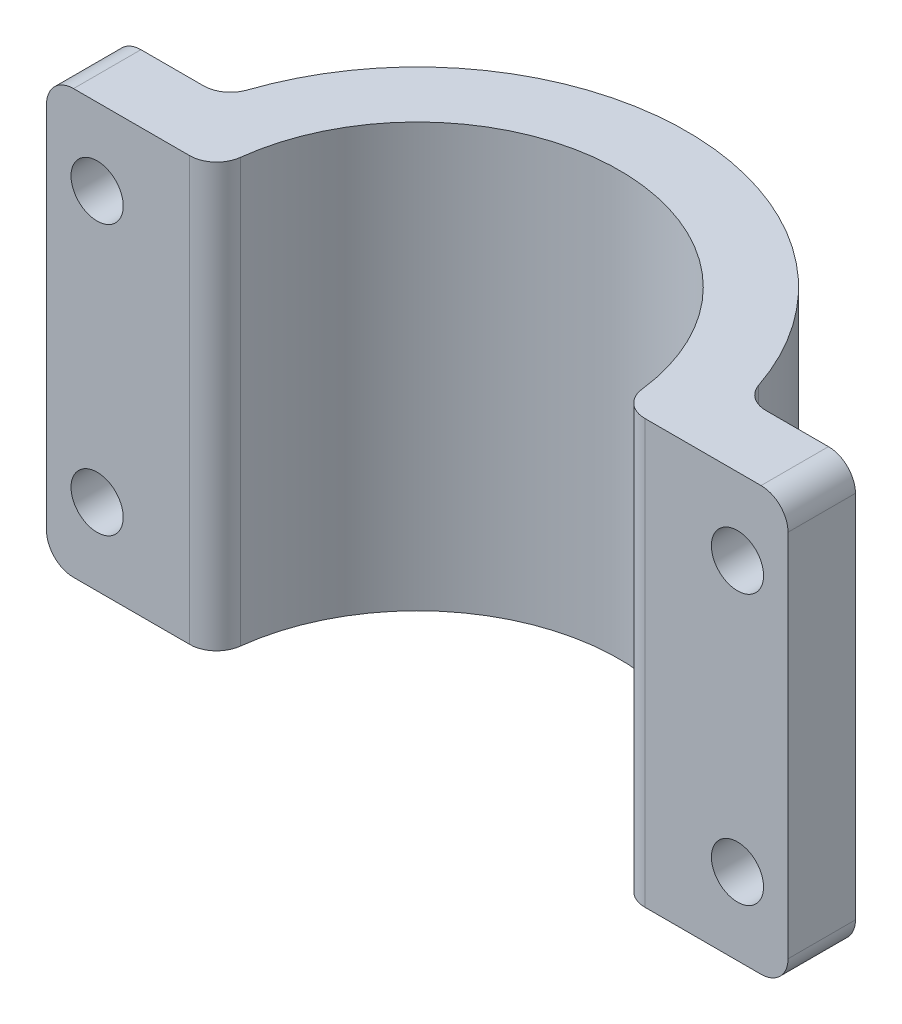
ISO-10303-21;
HEADER;
FILE_DESCRIPTION(('STEP AP214'),'2;1');
FILE_NAME('part.step','',(''),(''),'','','');
FILE_SCHEMA(('AUTOMOTIVE_DESIGN { 1 0 10303 214 1 1 1 1 }'));
ENDSEC;
DATA;
#1=APPLICATION_CONTEXT('core data for automotive mechanical design processes');
#2=APPLICATION_PROTOCOL_DEFINITION('international standard','automotive_design',2000,#1);
#3=PRODUCT_CONTEXT('',#1,'mechanical');
#4=PRODUCT('Part','Part','',(#3));
#5=PRODUCT_RELATED_PRODUCT_CATEGORY('part','',(#4));
#6=PRODUCT_DEFINITION_FORMATION('','',#4);
#7=PRODUCT_DEFINITION_CONTEXT('part definition',#1,'design');
#8=PRODUCT_DEFINITION('design','',#6,#7);
#9=PRODUCT_DEFINITION_SHAPE('','',#8);
#10=(LENGTH_UNIT() NAMED_UNIT(*) SI_UNIT(.MILLI.,.METRE.));
#11=(NAMED_UNIT(*) PLANE_ANGLE_UNIT() SI_UNIT($,.RADIAN.));
#12=(NAMED_UNIT(*) SI_UNIT($,.STERADIAN.) SOLID_ANGLE_UNIT());
#13=UNCERTAINTY_MEASURE_WITH_UNIT(LENGTH_MEASURE(1.E-05),#10,'distance_accuracy_value','');
#14=(GEOMETRIC_REPRESENTATION_CONTEXT(3) GLOBAL_UNCERTAINTY_ASSIGNED_CONTEXT((#13)) GLOBAL_UNIT_ASSIGNED_CONTEXT((#10,
#11,#12)) REPRESENTATION_CONTEXT('',''));
#15=CARTESIAN_POINT('',(0.,0.,0.));
#16=DIRECTION('',(0.,0.,1.));
#17=DIRECTION('',(1.,0.,0.));
#18=AXIS2_PLACEMENT_3D('',#15,#16,#17);
#19=CARTESIAN_POINT('',(-34.925,-39.878,0.));
#20=DIRECTION('',(-1.,0.,0.));
#21=DIRECTION('',(0.,0.,1.));
#22=AXIS2_PLACEMENT_3D('',#19,#20,#21);
#23=PLANE('',#22);
#24=DIRECTION('',(0.,1.,0.));
#25=VECTOR('',#24,1.);
#26=CARTESIAN_POINT('',(-34.925,-39.878,0.));
#27=LINE('',#26,#25);
#28=CARTESIAN_POINT('',(-34.925,-37.338,0.));
#29=VERTEX_POINT('',#28);
#30=CARTESIAN_POINT('',(-34.925,-2.54,0.));
#31=VERTEX_POINT('',#30);
#32=EDGE_CURVE('E257',#29,#31,#27,.T.);
#33=ORIENTED_EDGE('',*,*,#32,.T.);
#34=DIRECTION('',(0.,0.,1.));
#35=VECTOR('',#34,1.);
#36=CARTESIAN_POINT('',(-34.925,-2.54,0.));
#37=LINE('',#36,#35);
#38=CARTESIAN_POINT('',(-34.925,-2.54,-6.35));
#39=VERTEX_POINT('',#38);
#40=EDGE_CURVE('E191',#31,#39,#37,.F.);
#41=ORIENTED_EDGE('',*,*,#40,.T.);
#42=DIRECTION('',(0.,1.,0.));
#43=VECTOR('',#42,1.);
#44=CARTESIAN_POINT('',(-34.925,-39.878,-6.35));
#45=LINE('',#44,#43);
#46=CARTESIAN_POINT('',(-34.925,-37.338,-6.35));
#47=VERTEX_POINT('',#46);
#48=EDGE_CURVE('E245',#47,#39,#45,.T.);
#49=ORIENTED_EDGE('',*,*,#48,.F.);
#50=DIRECTION('',(0.,0.,1.));
#51=VECTOR('',#50,1.);
#52=CARTESIAN_POINT('',(-34.925,-37.338,0.));
#53=LINE('',#52,#51);
#54=EDGE_CURVE('E197',#47,#29,#53,.T.);
#55=ORIENTED_EDGE('',*,*,#54,.T.);
#56=EDGE_LOOP('',(#33,#41,#49,#55));
#57=FACE_BOUND('',#56,.T.);
#58=ADVANCED_FACE('F42',(#57),#23,.T.);
#59=CARTESIAN_POINT('',(-34.925,-39.878,-6.35));
#60=DIRECTION('',(0.,0.,-1.));
#61=DIRECTION('',(-1.,0.,0.));
#62=AXIS2_PLACEMENT_3D('',#59,#60,#61);
#63=PLANE('',#62);
#64=CARTESIAN_POINT('',(-30.1625,-7.239,-6.35));
#65=DIRECTION('',(0.,0.,-1.));
#66=DIRECTION('',(-1.,0.,0.));
#67=AXIS2_PLACEMENT_3D('',#64,#65,#66);
#68=CIRCLE('',#67,2.45744999999999);
#69=CARTESIAN_POINT('',(-32.61995,-7.239,-6.35));
#70=VERTEX_POINT('',#69);
#71=EDGE_CURVE('E399',#70,#70,#68,.T.);
#72=ORIENTED_EDGE('',*,*,#71,.F.);
#73=EDGE_LOOP('',(#72));
#74=FACE_BOUND('',#73,.T.);
#75=CARTESIAN_POINT('',(-30.1625,-32.639,-6.35));
#76=DIRECTION('',(0.,0.,-1.));
#77=DIRECTION('',(-1.,0.,0.));
#78=AXIS2_PLACEMENT_3D('',#75,#76,#77);
#79=CIRCLE('',#78,2.45744999999999);
#80=CARTESIAN_POINT('',(-32.61995,-32.639,-6.35));
#81=VERTEX_POINT('',#80);
#82=EDGE_CURVE('E391',#81,#81,#79,.T.);
#83=ORIENTED_EDGE('',*,*,#82,.F.);
#84=EDGE_LOOP('',(#83));
#85=FACE_BOUND('',#84,.T.);
#86=ORIENTED_EDGE('',*,*,#48,.T.);
#87=CARTESIAN_POINT('',(-32.385,-2.54,-6.35));
#88=DIRECTION('',(0.,0.,-1.));
#89=DIRECTION('',(-1.,0.,0.));
#90=AXIS2_PLACEMENT_3D('',#87,#88,#89);
#91=CIRCLE('',#90,2.54);
#92=CARTESIAN_POINT('',(-32.385,0.,-6.35));
#93=VERTEX_POINT('',#92);
#94=EDGE_CURVE('E283',#39,#93,#91,.T.);
#95=ORIENTED_EDGE('',*,*,#94,.T.);
#96=DIRECTION('',(-1.,0.,0.));
#97=VECTOR('',#96,1.);
#98=CARTESIAN_POINT('',(-34.925,0.,-6.35));
#99=LINE('',#98,#97);
#100=CARTESIAN_POINT('',(-26.48795009056,0.,-6.35));
#101=VERTEX_POINT('',#100);
#102=EDGE_CURVE('E206',#101,#93,#99,.T.);
#103=ORIENTED_EDGE('',*,*,#102,.F.);
#104=DIRECTION('',(0.,-1.,0.));
#105=VECTOR('',#104,1.);
#106=CARTESIAN_POINT('',(-26.48795009056,-39.878,-6.35));
#107=LINE('',#106,#105);
#108=CARTESIAN_POINT('',(-26.48795009056,-39.878,-6.35));
#109=VERTEX_POINT('',#108);
#110=EDGE_CURVE('E277',#101,#109,#107,.T.);
#111=ORIENTED_EDGE('',*,*,#110,.T.);
#112=DIRECTION('',(-1.,0.,0.));
#113=VECTOR('',#112,1.);
#114=CARTESIAN_POINT('',(-34.925,-39.878,-6.35));
#115=LINE('',#114,#113);
#116=CARTESIAN_POINT('',(-32.385,-39.878,-6.35));
#117=VERTEX_POINT('',#116);
#118=EDGE_CURVE('E228',#109,#117,#115,.T.);
#119=ORIENTED_EDGE('',*,*,#118,.T.);
#120=CARTESIAN_POINT('',(-32.385,-37.338,-6.35));
#121=DIRECTION('',(0.,0.,-1.));
#122=DIRECTION('',(-1.,0.,0.));
#123=AXIS2_PLACEMENT_3D('',#120,#121,#122);
#124=CIRCLE('',#123,2.54);
#125=EDGE_CURVE('E280',#117,#47,#124,.T.);
#126=ORIENTED_EDGE('',*,*,#125,.T.);
#127=EDGE_LOOP('',(#86,#95,#103,#111,#119,#126));
#128=FACE_BOUND('',#127,.T.);
#129=ADVANCED_FACE('F345',(#74,#85,#128),#63,.T.);
#130=CARTESIAN_POINT('',(0.,-39.878,0.));
#131=DIRECTION('',(0.,1.,0.));
#132=DIRECTION('',(0.,0.,1.));
#133=AXIS2_PLACEMENT_3D('',#130,#131,#132);
#134=CYLINDRICAL_SURFACE('',#133,25.4);
#135=CARTESIAN_POINT('',(0.,0.,0.));
#136=DIRECTION('',(0.,1.,0.));
#137=DIRECTION('',(0.,0.,1.));
#138=AXIS2_PLACEMENT_3D('',#135,#136,#137);
#139=CIRCLE('',#138,25.4);
#140=CARTESIAN_POINT('',(24.0799546277819,0.,-8.08181818181818));
#141=VERTEX_POINT('',#140);
#142=CARTESIAN_POINT('',(-24.0799546277819,0.,-8.08181818181818));
#143=VERTEX_POINT('',#142);
#144=EDGE_CURVE('E238',#141,#143,#139,.T.);
#145=ORIENTED_EDGE('',*,*,#144,.F.);
#146=DIRECTION('',(0.,1.,0.));
#147=VECTOR('',#146,1.);
#148=CARTESIAN_POINT('',(24.0799546277819,-39.878,-8.08181818181818));
#149=LINE('',#148,#147);
#150=CARTESIAN_POINT('',(24.0799546277819,-39.878,-8.08181818181818));
#151=VERTEX_POINT('',#150);
#152=EDGE_CURVE('E331',#141,#151,#149,.F.);
#153=ORIENTED_EDGE('',*,*,#152,.T.);
#154=CARTESIAN_POINT('',(0.,-39.878,0.));
#155=DIRECTION('',(0.,1.,0.));
#156=DIRECTION('',(0.,0.,1.));
#157=AXIS2_PLACEMENT_3D('',#154,#155,#156);
#158=CIRCLE('',#157,25.4);
#159=CARTESIAN_POINT('',(-24.0799546277819,-39.878,-8.08181818181818));
#160=VERTEX_POINT('',#159);
#161=EDGE_CURVE('E355',#151,#160,#158,.T.);
#162=ORIENTED_EDGE('',*,*,#161,.T.);
#163=DIRECTION('',(0.,1.,0.));
#164=VECTOR('',#163,1.);
#165=CARTESIAN_POINT('',(-24.0799546277819,-39.878,-8.08181818181818));
#166=LINE('',#165,#164);
#167=EDGE_CURVE('E327',#160,#143,#166,.T.);
#168=ORIENTED_EDGE('',*,*,#167,.T.);
#169=EDGE_LOOP('',(#145,#153,#162,#168));
#170=FACE_BOUND('',#169,.T.);
#171=ADVANCED_FACE('F358',(#170),#134,.T.);
#172=CARTESIAN_POINT('',(34.925,-39.878,-6.35));
#173=DIRECTION('',(0.,0.,-1.));
#174=DIRECTION('',(-1.,0.,0.));
#175=AXIS2_PLACEMENT_3D('',#172,#173,#174);
#176=PLANE('',#175);
#177=CARTESIAN_POINT('',(30.1625,-7.239,-6.35));
#178=DIRECTION('',(0.,0.,-1.));
#179=DIRECTION('',(-1.,0.,0.));
#180=AXIS2_PLACEMENT_3D('',#177,#178,#179);
#181=CIRCLE('',#180,2.45744999999999);
#182=CARTESIAN_POINT('',(27.70505,-7.239,-6.35));
#183=VERTEX_POINT('',#182);
#184=EDGE_CURVE('E383',#183,#183,#181,.T.);
#185=ORIENTED_EDGE('',*,*,#184,.F.);
#186=EDGE_LOOP('',(#185));
#187=FACE_BOUND('',#186,.T.);
#188=CARTESIAN_POINT('',(30.1625,-32.639,-6.35));
#189=DIRECTION('',(0.,0.,-1.));
#190=DIRECTION('',(-1.,0.,0.));
#191=AXIS2_PLACEMENT_3D('',#188,#189,#190);
#192=CIRCLE('',#191,2.45744999999999);
#193=CARTESIAN_POINT('',(27.70505,-32.639,-6.35));
#194=VERTEX_POINT('',#193);
#195=EDGE_CURVE('E225',#194,#194,#192,.T.);
#196=ORIENTED_EDGE('',*,*,#195,.F.);
#197=EDGE_LOOP('',(#196));
#198=FACE_BOUND('',#197,.T.);
#199=DIRECTION('',(0.,1.,0.));
#200=VECTOR('',#199,1.);
#201=CARTESIAN_POINT('',(34.925,-39.878,-6.35));
#202=LINE('',#201,#200);
#203=CARTESIAN_POINT('',(34.925,-37.338,-6.35));
#204=VERTEX_POINT('',#203);
#205=CARTESIAN_POINT('',(34.925,-2.54,-6.35));
#206=VERTEX_POINT('',#205);
#207=EDGE_CURVE('E250',#204,#206,#202,.T.);
#208=ORIENTED_EDGE('',*,*,#207,.F.);
#209=CARTESIAN_POINT('',(32.385,-37.338,-6.35));
#210=DIRECTION('',(0.,0.,-1.));
#211=DIRECTION('',(-1.,0.,0.));
#212=AXIS2_PLACEMENT_3D('',#209,#210,#211);
#213=CIRCLE('',#212,2.54);
#214=CARTESIAN_POINT('',(32.385,-39.878,-6.35));
#215=VERTEX_POINT('',#214);
#216=EDGE_CURVE('E71',#204,#215,#213,.T.);
#217=ORIENTED_EDGE('',*,*,#216,.T.);
#218=DIRECTION('',(-1.,0.,0.));
#219=VECTOR('',#218,1.);
#220=CARTESIAN_POINT('',(34.925,-39.878,-6.35));
#221=LINE('',#220,#219);
#222=CARTESIAN_POINT('',(26.48795009056,-39.878,-6.35));
#223=VERTEX_POINT('',#222);
#224=EDGE_CURVE('E361',#215,#223,#221,.T.);
#225=ORIENTED_EDGE('',*,*,#224,.T.);
#226=DIRECTION('',(0.,-1.,0.));
#227=VECTOR('',#226,1.);
#228=CARTESIAN_POINT('',(26.48795009056,0.,-6.35));
#229=LINE('',#228,#227);
#230=CARTESIAN_POINT('',(26.48795009056,0.,-6.35));
#231=VERTEX_POINT('',#230);
#232=EDGE_CURVE('E304',#223,#231,#229,.F.);
#233=ORIENTED_EDGE('',*,*,#232,.T.);
#234=DIRECTION('',(-1.,0.,0.));
#235=VECTOR('',#234,1.);
#236=CARTESIAN_POINT('',(34.925,0.,-6.35));
#237=LINE('',#236,#235);
#238=CARTESIAN_POINT('',(32.385,0.,-6.35));
#239=VERTEX_POINT('',#238);
#240=EDGE_CURVE('E234',#239,#231,#237,.T.);
#241=ORIENTED_EDGE('',*,*,#240,.F.);
#242=CARTESIAN_POINT('',(32.385,-2.54,-6.35));
#243=DIRECTION('',(0.,0.,-1.));
#244=DIRECTION('',(-1.,0.,0.));
#245=AXIS2_PLACEMENT_3D('',#242,#243,#244);
#246=CIRCLE('',#245,2.54);
#247=EDGE_CURVE('E61',#239,#206,#246,.T.);
#248=ORIENTED_EDGE('',*,*,#247,.T.);
#249=EDGE_LOOP('',(#208,#217,#225,#233,#241,#248));
#250=FACE_BOUND('',#249,.T.);
#251=ADVANCED_FACE('F485',(#187,#198,#250),#176,.T.);
#252=CARTESIAN_POINT('',(34.925,-39.878,0.));
#253=DIRECTION('',(1.,0.,0.));
#254=DIRECTION('',(0.,0.,-1.));
#255=AXIS2_PLACEMENT_3D('',#252,#253,#254);
#256=PLANE('',#255);
#257=DIRECTION('',(0.,1.,0.));
#258=VECTOR('',#257,1.);
#259=CARTESIAN_POINT('',(34.925,-39.878,0.));
#260=LINE('',#259,#258);
#261=CARTESIAN_POINT('',(34.925,-37.338,0.));
#262=VERTEX_POINT('',#261);
#263=CARTESIAN_POINT('',(34.925,-2.54,0.));
#264=VERTEX_POINT('',#263);
#265=EDGE_CURVE('E253',#262,#264,#260,.T.);
#266=ORIENTED_EDGE('',*,*,#265,.F.);
#267=DIRECTION('',(0.,0.,-1.));
#268=VECTOR('',#267,1.);
#269=CARTESIAN_POINT('',(34.925,-37.338,-6.35));
#270=LINE('',#269,#268);
#271=EDGE_CURVE('E301',#262,#204,#270,.T.);
#272=ORIENTED_EDGE('',*,*,#271,.T.);
#273=ORIENTED_EDGE('',*,*,#207,.T.);
#274=DIRECTION('',(0.,0.,-1.));
#275=VECTOR('',#274,1.);
#276=CARTESIAN_POINT('',(34.925,-2.54,0.));
#277=LINE('',#276,#275);
#278=EDGE_CURVE('E298',#206,#264,#277,.F.);
#279=ORIENTED_EDGE('',*,*,#278,.T.);
#280=EDGE_LOOP('',(#266,#272,#273,#279));
#281=FACE_BOUND('',#280,.T.);
#282=ADVANCED_FACE('F490',(#281),#256,.T.);
#283=CARTESIAN_POINT('',(19.05,-39.878,0.));
#284=DIRECTION('',(0.,0.,1.));
#285=DIRECTION('',(1.,0.,0.));
#286=AXIS2_PLACEMENT_3D('',#283,#284,#285);
#287=PLANE('',#286);
#288=CARTESIAN_POINT('',(30.1625,-7.239,0.));
#289=DIRECTION('',(0.,0.,-1.));
#290=DIRECTION('',(-1.,0.,0.));
#291=AXIS2_PLACEMENT_3D('',#288,#289,#290);
#292=CIRCLE('',#291,2.45744999999999);
#293=CARTESIAN_POINT('',(27.70505,-7.239,0.));
#294=VERTEX_POINT('',#293);
#295=EDGE_CURVE('E379',#294,#294,#292,.T.);
#296=ORIENTED_EDGE('',*,*,#295,.T.);
#297=EDGE_LOOP('',(#296));
#298=FACE_BOUND('',#297,.T.);
#299=CARTESIAN_POINT('',(30.1625,-32.639,0.));
#300=DIRECTION('',(0.,0.,-1.));
#301=DIRECTION('',(-1.,0.,0.));
#302=AXIS2_PLACEMENT_3D('',#299,#300,#301);
#303=CIRCLE('',#302,2.45745);
#304=CARTESIAN_POINT('',(27.70505,-32.639,0.));
#305=VERTEX_POINT('',#304);
#306=EDGE_CURVE('E217',#305,#305,#303,.T.);
#307=ORIENTED_EDGE('',*,*,#306,.T.);
#308=EDGE_LOOP('',(#307));
#309=FACE_BOUND('',#308,.T.);
#310=DIRECTION('',(1.,0.,0.));
#311=VECTOR('',#310,1.);
#312=CARTESIAN_POINT('',(19.05,-39.878,0.));
#313=LINE('',#312,#311);
#314=CARTESIAN_POINT('',(21.4400676304903,-39.878,0.));
#315=VERTEX_POINT('',#314);
#316=CARTESIAN_POINT('',(32.385,-39.878,0.));
#317=VERTEX_POINT('',#316);
#318=EDGE_CURVE('E366',#315,#317,#313,.T.);
#319=ORIENTED_EDGE('',*,*,#318,.T.);
#320=CARTESIAN_POINT('',(32.385,-37.338,0.));
#321=DIRECTION('',(0.,0.,1.));
#322=DIRECTION('',(1.,0.,0.));
#323=AXIS2_PLACEMENT_3D('',#320,#321,#322);
#324=CIRCLE('',#323,2.54);
#325=EDGE_CURVE('E318',#317,#262,#324,.T.);
#326=ORIENTED_EDGE('',*,*,#325,.T.);
#327=ORIENTED_EDGE('',*,*,#265,.T.);
#328=CARTESIAN_POINT('',(32.385,-2.54,0.));
#329=DIRECTION('',(0.,0.,1.));
#330=DIRECTION('',(1.,0.,0.));
#331=AXIS2_PLACEMENT_3D('',#328,#329,#330);
#332=CIRCLE('',#331,2.54);
#333=CARTESIAN_POINT('',(32.385,0.,0.));
#334=VERTEX_POINT('',#333);
#335=EDGE_CURVE('E315',#264,#334,#332,.T.);
#336=ORIENTED_EDGE('',*,*,#335,.T.);
#337=DIRECTION('',(1.,0.,0.));
#338=VECTOR('',#337,1.);
#339=CARTESIAN_POINT('',(19.05,0.,0.));
#340=LINE('',#339,#338);
#341=CARTESIAN_POINT('',(21.4400676304903,0.,0.));
#342=VERTEX_POINT('',#341);
#343=EDGE_CURVE('E221',#342,#334,#340,.T.);
#344=ORIENTED_EDGE('',*,*,#343,.F.);
#345=DIRECTION('',(0.,1.,0.));
#346=VECTOR('',#345,1.);
#347=CARTESIAN_POINT('',(21.4400676304903,-39.878,0.));
#348=LINE('',#347,#346);
#349=EDGE_CURVE('E312',#342,#315,#348,.F.);
#350=ORIENTED_EDGE('',*,*,#349,.T.);
#351=EDGE_LOOP('',(#319,#326,#327,#336,#344,#350));
#352=FACE_BOUND('',#351,.T.);
#353=ADVANCED_FACE('F481',(#298,#309,#352),#287,.T.);
#354=CARTESIAN_POINT('',(0.,-39.878,0.));
#355=DIRECTION('',(0.,1.,0.));
#356=DIRECTION('',(0.,0.,1.));
#357=AXIS2_PLACEMENT_3D('',#354,#355,#356);
#358=CYLINDRICAL_SURFACE('',#357,19.05);
#359=CARTESIAN_POINT('',(0.,-39.878,0.));
#360=DIRECTION('',(0.,-1.,0.));
#361=DIRECTION('',(0.,0.,1.));
#362=AXIS2_PLACEMENT_3D('',#359,#360,#361);
#363=CIRCLE('',#362,19.05);
#364=CARTESIAN_POINT('',(-18.9177067327856,-39.878,-2.24117647058824));
#365=VERTEX_POINT('',#364);
#366=CARTESIAN_POINT('',(18.9177067327856,-39.878,-2.24117647058824));
#367=VERTEX_POINT('',#366);
#368=EDGE_CURVE('E371',#365,#367,#363,.T.);
#369=ORIENTED_EDGE('',*,*,#368,.T.);
#370=DIRECTION('',(0.,1.,0.));
#371=VECTOR('',#370,1.);
#372=CARTESIAN_POINT('',(18.9177067327856,-39.878,-2.24117647058824));
#373=LINE('',#372,#371);
#374=CARTESIAN_POINT('',(18.9177067327856,0.,-2.24117647058824));
#375=VERTEX_POINT('',#374);
#376=EDGE_CURVE('E323',#367,#375,#373,.T.);
#377=ORIENTED_EDGE('',*,*,#376,.T.);
#378=CARTESIAN_POINT('',(0.,0.,0.));
#379=DIRECTION('',(0.,-1.,0.));
#380=DIRECTION('',(0.,0.,1.));
#381=AXIS2_PLACEMENT_3D('',#378,#379,#380);
#382=CIRCLE('',#381,19.05);
#383=CARTESIAN_POINT('',(-18.9177067327856,0.,-2.24117647058824));
#384=VERTEX_POINT('',#383);
#385=EDGE_CURVE('E216',#384,#375,#382,.T.);
#386=ORIENTED_EDGE('',*,*,#385,.F.);
#387=DIRECTION('',(0.,1.,0.));
#388=VECTOR('',#387,1.);
#389=CARTESIAN_POINT('',(-18.9177067327856,-39.878,-2.24117647058824));
#390=LINE('',#389,#388);
#391=EDGE_CURVE('E320',#384,#365,#390,.F.);
#392=ORIENTED_EDGE('',*,*,#391,.T.);
#393=EDGE_LOOP('',(#369,#377,#386,#392));
#394=FACE_BOUND('',#393,.T.);
#395=ADVANCED_FACE('F475',(#394),#358,.F.);
#396=CARTESIAN_POINT('',(-34.925,-39.878,0.));
#397=DIRECTION('',(0.,0.,1.));
#398=DIRECTION('',(1.,0.,0.));
#399=AXIS2_PLACEMENT_3D('',#396,#397,#398);
#400=PLANE('',#399);
#401=CARTESIAN_POINT('',(-30.1625,-7.239,0.));
#402=DIRECTION('',(0.,0.,-1.));
#403=DIRECTION('',(-1.,0.,0.));
#404=AXIS2_PLACEMENT_3D('',#401,#402,#403);
#405=CIRCLE('',#404,2.45745);
#406=CARTESIAN_POINT('',(-32.61995,-7.239,0.));
#407=VERTEX_POINT('',#406);
#408=EDGE_CURVE('E395',#407,#407,#405,.T.);
#409=ORIENTED_EDGE('',*,*,#408,.T.);
#410=EDGE_LOOP('',(#409));
#411=FACE_BOUND('',#410,.T.);
#412=CARTESIAN_POINT('',(-30.1625,-32.639,0.));
#413=DIRECTION('',(0.,0.,-1.));
#414=DIRECTION('',(-1.,0.,0.));
#415=AXIS2_PLACEMENT_3D('',#412,#413,#414);
#416=CIRCLE('',#415,2.45745);
#417=CARTESIAN_POINT('',(-32.61995,-32.639,0.));
#418=VERTEX_POINT('',#417);
#419=EDGE_CURVE('E387',#418,#418,#416,.T.);
#420=ORIENTED_EDGE('',*,*,#419,.T.);
#421=EDGE_LOOP('',(#420));
#422=FACE_BOUND('',#421,.T.);
#423=DIRECTION('',(1.,0.,0.));
#424=VECTOR('',#423,1.);
#425=CARTESIAN_POINT('',(-34.925,0.,0.));
#426=LINE('',#425,#424);
#427=CARTESIAN_POINT('',(-32.385,0.,0.));
#428=VERTEX_POINT('',#427);
#429=CARTESIAN_POINT('',(-21.4400676304903,0.,0.));
#430=VERTEX_POINT('',#429);
#431=EDGE_CURVE('E204',#428,#430,#426,.T.);
#432=ORIENTED_EDGE('',*,*,#431,.F.);
#433=CARTESIAN_POINT('',(-32.385,-2.54,0.));
#434=DIRECTION('',(0.,0.,1.));
#435=DIRECTION('',(1.,0.,0.));
#436=AXIS2_PLACEMENT_3D('',#433,#434,#435);
#437=CIRCLE('',#436,2.54);
#438=EDGE_CURVE('E186',#428,#31,#437,.T.);
#439=ORIENTED_EDGE('',*,*,#438,.T.);
#440=ORIENTED_EDGE('',*,*,#32,.F.);
#441=CARTESIAN_POINT('',(-32.385,-37.338,0.));
#442=DIRECTION('',(0.,0.,1.));
#443=DIRECTION('',(1.,0.,0.));
#444=AXIS2_PLACEMENT_3D('',#441,#442,#443);
#445=CIRCLE('',#444,2.54);
#446=CARTESIAN_POINT('',(-32.385,-39.878,0.));
#447=VERTEX_POINT('',#446);
#448=EDGE_CURVE('E198',#29,#447,#445,.T.);
#449=ORIENTED_EDGE('',*,*,#448,.T.);
#450=DIRECTION('',(1.,0.,0.));
#451=VECTOR('',#450,1.);
#452=CARTESIAN_POINT('',(-34.925,-39.878,0.));
#453=LINE('',#452,#451);
#454=CARTESIAN_POINT('',(-21.4400676304903,-39.878,0.));
#455=VERTEX_POINT('',#454);
#456=EDGE_CURVE('E244',#447,#455,#453,.T.);
#457=ORIENTED_EDGE('',*,*,#456,.T.);
#458=DIRECTION('',(0.,1.,0.));
#459=VECTOR('',#458,1.);
#460=CARTESIAN_POINT('',(-21.4400676304903,-39.878,0.));
#461=LINE('',#460,#459);
#462=EDGE_CURVE('E208',#455,#430,#461,.T.);
#463=ORIENTED_EDGE('',*,*,#462,.T.);
#464=EDGE_LOOP('',(#432,#439,#440,#449,#457,#463));
#465=FACE_BOUND('',#464,.T.);
#466=ADVANCED_FACE('F212',(#411,#422,#465),#400,.T.);
#467=CARTESIAN_POINT('',(0.,-39.878,0.));
#468=DIRECTION('',(0.,1.,0.));
#469=DIRECTION('',(0.,0.,1.));
#470=AXIS2_PLACEMENT_3D('',#467,#468,#469);
#471=PLANE('',#470);
#472=ORIENTED_EDGE('',*,*,#456,.F.);
#473=DIRECTION('',(0.,0.,1.));
#474=VECTOR('',#473,1.);
#475=CARTESIAN_POINT('',(-32.385,-39.878,-6.35));
#476=LINE('',#475,#474);
#477=EDGE_CURVE('E295',#447,#117,#476,.F.);
#478=ORIENTED_EDGE('',*,*,#477,.T.);
#479=ORIENTED_EDGE('',*,*,#118,.F.);
#480=CARTESIAN_POINT('',(-26.48795009056,-39.878,-8.89));
#481=DIRECTION('',(0.,1.,0.));
#482=DIRECTION('',(0.,0.,1.));
#483=AXIS2_PLACEMENT_3D('',#480,#481,#482);
#484=CIRCLE('',#483,2.54);
#485=EDGE_CURVE('E11',#109,#160,#484,.T.);
#486=ORIENTED_EDGE('',*,*,#485,.T.);
#487=ORIENTED_EDGE('',*,*,#161,.F.);
#488=CARTESIAN_POINT('',(26.48795009056,-39.878,-8.89));
#489=DIRECTION('',(0.,1.,0.));
#490=DIRECTION('',(0.,0.,1.));
#491=AXIS2_PLACEMENT_3D('',#488,#489,#490);
#492=CIRCLE('',#491,2.54);
#493=EDGE_CURVE('E337',#151,#223,#492,.T.);
#494=ORIENTED_EDGE('',*,*,#493,.T.);
#495=ORIENTED_EDGE('',*,*,#224,.F.);
#496=DIRECTION('',(0.,0.,-1.));
#497=VECTOR('',#496,1.);
#498=CARTESIAN_POINT('',(32.385,-39.878,0.));
#499=LINE('',#498,#497);
#500=EDGE_CURVE('E292',#215,#317,#499,.F.);
#501=ORIENTED_EDGE('',*,*,#500,.T.);
#502=ORIENTED_EDGE('',*,*,#318,.F.);
#503=CARTESIAN_POINT('',(21.4400676304903,-39.878,-2.54));
#504=DIRECTION('',(0.,1.,0.));
#505=DIRECTION('',(0.,0.,1.));
#506=AXIS2_PLACEMENT_3D('',#503,#504,#505);
#507=CIRCLE('',#506,2.54);
#508=EDGE_CURVE('E289',#315,#367,#507,.F.);
#509=ORIENTED_EDGE('',*,*,#508,.T.);
#510=ORIENTED_EDGE('',*,*,#368,.F.);
#511=CARTESIAN_POINT('',(-21.4400676304903,-39.878,-2.54));
#512=DIRECTION('',(0.,1.,0.));
#513=DIRECTION('',(0.,0.,1.));
#514=AXIS2_PLACEMENT_3D('',#511,#512,#513);
#515=CIRCLE('',#514,2.54);
#516=EDGE_CURVE('E286',#365,#455,#515,.F.);
#517=ORIENTED_EDGE('',*,*,#516,.T.);
#518=EDGE_LOOP('',(#472,#478,#479,#486,#487,#494,#495,#501,#502,#509,#510,#517));
#519=FACE_BOUND('',#518,.T.);
#520=ADVANCED_FACE('F354',(#519),#471,.F.);
#521=CARTESIAN_POINT('',(0.,0.,0.));
#522=DIRECTION('',(0.,1.,0.));
#523=DIRECTION('',(0.,0.,1.));
#524=AXIS2_PLACEMENT_3D('',#521,#522,#523);
#525=PLANE('',#524);
#526=ORIENTED_EDGE('',*,*,#102,.T.);
#527=DIRECTION('',(0.,0.,1.));
#528=VECTOR('',#527,1.);
#529=CARTESIAN_POINT('',(-32.385,0.,0.));
#530=LINE('',#529,#528);
#531=EDGE_CURVE('E190',#93,#428,#530,.T.);
#532=ORIENTED_EDGE('',*,*,#531,.T.);
#533=ORIENTED_EDGE('',*,*,#431,.T.);
#534=CARTESIAN_POINT('',(-21.4400676304903,0.,-2.54));
#535=DIRECTION('',(0.,1.,0.));
#536=DIRECTION('',(0.,0.,1.));
#537=AXIS2_PLACEMENT_3D('',#534,#535,#536);
#538=CIRCLE('',#537,2.54);
#539=EDGE_CURVE('E249',#430,#384,#538,.T.);
#540=ORIENTED_EDGE('',*,*,#539,.T.);
#541=ORIENTED_EDGE('',*,*,#385,.T.);
#542=CARTESIAN_POINT('',(21.4400676304903,0.,-2.54));
#543=DIRECTION('',(0.,1.,0.));
#544=DIRECTION('',(0.,0.,1.));
#545=AXIS2_PLACEMENT_3D('',#542,#543,#544);
#546=CIRCLE('',#545,2.54);
#547=EDGE_CURVE('E262',#375,#342,#546,.T.);
#548=ORIENTED_EDGE('',*,*,#547,.T.);
#549=ORIENTED_EDGE('',*,*,#343,.T.);
#550=DIRECTION('',(0.,0.,-1.));
#551=VECTOR('',#550,1.);
#552=CARTESIAN_POINT('',(32.385,0.,0.));
#553=LINE('',#552,#551);
#554=EDGE_CURVE('E209',#334,#239,#553,.T.);
#555=ORIENTED_EDGE('',*,*,#554,.T.);
#556=ORIENTED_EDGE('',*,*,#240,.T.);
#557=CARTESIAN_POINT('',(26.48795009056,0.,-8.89));
#558=DIRECTION('',(0.,1.,0.));
#559=DIRECTION('',(0.,0.,1.));
#560=AXIS2_PLACEMENT_3D('',#557,#558,#559);
#561=CIRCLE('',#560,2.54);
#562=EDGE_CURVE('E334',#231,#141,#561,.F.);
#563=ORIENTED_EDGE('',*,*,#562,.T.);
#564=ORIENTED_EDGE('',*,*,#144,.T.);
#565=CARTESIAN_POINT('',(-26.48795009056,0.,-8.89));
#566=DIRECTION('',(0.,1.,0.));
#567=DIRECTION('',(0.,0.,1.));
#568=AXIS2_PLACEMENT_3D('',#565,#566,#567);
#569=CIRCLE('',#568,2.54);
#570=EDGE_CURVE('E51',#143,#101,#569,.F.);
#571=ORIENTED_EDGE('',*,*,#570,.T.);
#572=EDGE_LOOP('',(#526,#532,#533,#540,#541,#548,#549,#555,#556,#563,#564,#571));
#573=FACE_BOUND('',#572,.T.);
#574=ADVANCED_FACE('F203',(#573),#525,.T.);
#575=CARTESIAN_POINT('',(-32.385,-2.54,0.));
#576=DIRECTION('',(0.,0.,1.));
#577=DIRECTION('',(1.,0.,0.));
#578=AXIS2_PLACEMENT_3D('',#575,#576,#577);
#579=CYLINDRICAL_SURFACE('',#578,2.54);
#580=ORIENTED_EDGE('',*,*,#94,.F.);
#581=ORIENTED_EDGE('',*,*,#40,.F.);
#582=ORIENTED_EDGE('',*,*,#438,.F.);
#583=ORIENTED_EDGE('',*,*,#531,.F.);
#584=EDGE_LOOP('',(#580,#581,#582,#583));
#585=FACE_BOUND('',#584,.T.);
#586=ADVANCED_FACE('F189',(#585),#579,.T.);
#587=CARTESIAN_POINT('',(-32.385,-37.338,0.));
#588=DIRECTION('',(0.,0.,-1.));
#589=DIRECTION('',(-1.,0.,0.));
#590=AXIS2_PLACEMENT_3D('',#587,#588,#589);
#591=CYLINDRICAL_SURFACE('',#590,2.54);
#592=ORIENTED_EDGE('',*,*,#125,.F.);
#593=ORIENTED_EDGE('',*,*,#477,.F.);
#594=ORIENTED_EDGE('',*,*,#448,.F.);
#595=ORIENTED_EDGE('',*,*,#54,.F.);
#596=EDGE_LOOP('',(#592,#593,#594,#595));
#597=FACE_BOUND('',#596,.T.);
#598=ADVANCED_FACE('F436',(#597),#591,.T.);
#599=CARTESIAN_POINT('',(32.385,-37.338,0.));
#600=DIRECTION('',(0.,0.,1.));
#601=DIRECTION('',(1.,0.,0.));
#602=AXIS2_PLACEMENT_3D('',#599,#600,#601);
#603=CYLINDRICAL_SURFACE('',#602,2.54);
#604=ORIENTED_EDGE('',*,*,#325,.F.);
#605=ORIENTED_EDGE('',*,*,#500,.F.);
#606=ORIENTED_EDGE('',*,*,#216,.F.);
#607=ORIENTED_EDGE('',*,*,#271,.F.);
#608=EDGE_LOOP('',(#604,#605,#606,#607));
#609=FACE_BOUND('',#608,.T.);
#610=ADVANCED_FACE('F439',(#609),#603,.T.);
#611=CARTESIAN_POINT('',(32.385,-2.54,0.));
#612=DIRECTION('',(0.,0.,-1.));
#613=DIRECTION('',(-1.,0.,0.));
#614=AXIS2_PLACEMENT_3D('',#611,#612,#613);
#615=CYLINDRICAL_SURFACE('',#614,2.54);
#616=ORIENTED_EDGE('',*,*,#335,.F.);
#617=ORIENTED_EDGE('',*,*,#278,.F.);
#618=ORIENTED_EDGE('',*,*,#247,.F.);
#619=ORIENTED_EDGE('',*,*,#554,.F.);
#620=EDGE_LOOP('',(#616,#617,#618,#619));
#621=FACE_BOUND('',#620,.T.);
#622=ADVANCED_FACE('F443',(#621),#615,.T.);
#623=CARTESIAN_POINT('',(21.4400676304903,-39.878,-2.54));
#624=DIRECTION('',(0.,1.,0.));
#625=DIRECTION('',(0.,0.,1.));
#626=AXIS2_PLACEMENT_3D('',#623,#624,#625);
#627=CYLINDRICAL_SURFACE('',#626,2.54);
#628=ORIENTED_EDGE('',*,*,#508,.F.);
#629=ORIENTED_EDGE('',*,*,#349,.F.);
#630=ORIENTED_EDGE('',*,*,#547,.F.);
#631=ORIENTED_EDGE('',*,*,#376,.F.);
#632=EDGE_LOOP('',(#628,#629,#630,#631));
#633=FACE_BOUND('',#632,.T.);
#634=ADVANCED_FACE('F446',(#633),#627,.T.);
#635=CARTESIAN_POINT('',(26.48795009056,-39.878,-8.89));
#636=DIRECTION('',(0.,1.,0.));
#637=DIRECTION('',(0.,0.,1.));
#638=AXIS2_PLACEMENT_3D('',#635,#636,#637);
#639=CYLINDRICAL_SURFACE('',#638,2.54);
#640=ORIENTED_EDGE('',*,*,#493,.F.);
#641=ORIENTED_EDGE('',*,*,#152,.F.);
#642=ORIENTED_EDGE('',*,*,#562,.F.);
#643=ORIENTED_EDGE('',*,*,#232,.F.);
#644=EDGE_LOOP('',(#640,#641,#642,#643));
#645=FACE_BOUND('',#644,.T.);
#646=ADVANCED_FACE('F450',(#645),#639,.F.);
#647=CARTESIAN_POINT('',(-26.48795009056,-39.878,-8.89));
#648=DIRECTION('',(0.,1.,0.));
#649=DIRECTION('',(0.,0.,1.));
#650=AXIS2_PLACEMENT_3D('',#647,#648,#649);
#651=CYLINDRICAL_SURFACE('',#650,2.54);
#652=ORIENTED_EDGE('',*,*,#485,.F.);
#653=ORIENTED_EDGE('',*,*,#110,.F.);
#654=ORIENTED_EDGE('',*,*,#570,.F.);
#655=ORIENTED_EDGE('',*,*,#167,.F.);
#656=EDGE_LOOP('',(#652,#653,#654,#655));
#657=FACE_BOUND('',#656,.T.);
#658=ADVANCED_FACE('F349',(#657),#651,.F.);
#659=CARTESIAN_POINT('',(-21.4400676304903,-39.878,-2.54));
#660=DIRECTION('',(0.,1.,0.));
#661=DIRECTION('',(0.,0.,1.));
#662=AXIS2_PLACEMENT_3D('',#659,#660,#661);
#663=CYLINDRICAL_SURFACE('',#662,2.54);
#664=ORIENTED_EDGE('',*,*,#516,.F.);
#665=ORIENTED_EDGE('',*,*,#391,.F.);
#666=ORIENTED_EDGE('',*,*,#539,.F.);
#667=ORIENTED_EDGE('',*,*,#462,.F.);
#668=EDGE_LOOP('',(#664,#665,#666,#667));
#669=FACE_BOUND('',#668,.T.);
#670=ADVANCED_FACE('F44',(#669),#663,.T.);
#671=CARTESIAN_POINT('',(30.1625,-32.639,-6.35));
#672=DIRECTION('',(0.,0.,-1.));
#673=DIRECTION('',(-1.,0.,0.));
#674=AXIS2_PLACEMENT_3D('',#671,#672,#673);
#675=CYLINDRICAL_SURFACE('',#674,2.45744999999999);
#676=ORIENTED_EDGE('',*,*,#306,.F.);
#677=EDGE_LOOP('',(#676));
#678=FACE_BOUND('',#677,.T.);
#679=ORIENTED_EDGE('',*,*,#195,.T.);
#680=EDGE_LOOP('',(#679));
#681=FACE_BOUND('',#680,.T.);
#682=ADVANCED_FACE('F422',(#678,#681),#675,.F.);
#683=CARTESIAN_POINT('',(30.1625,-7.239,-6.35));
#684=DIRECTION('',(0.,0.,-1.));
#685=DIRECTION('',(-1.,0.,0.));
#686=AXIS2_PLACEMENT_3D('',#683,#684,#685);
#687=CYLINDRICAL_SURFACE('',#686,2.45744999999999);
#688=ORIENTED_EDGE('',*,*,#295,.F.);
#689=EDGE_LOOP('',(#688));
#690=FACE_BOUND('',#689,.T.);
#691=ORIENTED_EDGE('',*,*,#184,.T.);
#692=EDGE_LOOP('',(#691));
#693=FACE_BOUND('',#692,.T.);
#694=ADVANCED_FACE('F413',(#690,#693),#687,.F.);
#695=CARTESIAN_POINT('',(-30.1625,-32.639,-6.35));
#696=DIRECTION('',(0.,0.,-1.));
#697=DIRECTION('',(-1.,0.,0.));
#698=AXIS2_PLACEMENT_3D('',#695,#696,#697);
#699=CYLINDRICAL_SURFACE('',#698,2.45744999999999);
#700=ORIENTED_EDGE('',*,*,#419,.F.);
#701=EDGE_LOOP('',(#700));
#702=FACE_BOUND('',#701,.T.);
#703=ORIENTED_EDGE('',*,*,#82,.T.);
#704=EDGE_LOOP('',(#703));
#705=FACE_BOUND('',#704,.T.);
#706=ADVANCED_FACE('F411',(#702,#705),#699,.F.);
#707=CARTESIAN_POINT('',(-30.1625,-7.239,-6.35));
#708=DIRECTION('',(0.,0.,-1.));
#709=DIRECTION('',(-1.,0.,0.));
#710=AXIS2_PLACEMENT_3D('',#707,#708,#709);
#711=CYLINDRICAL_SURFACE('',#710,2.45744999999999);
#712=ORIENTED_EDGE('',*,*,#408,.F.);
#713=EDGE_LOOP('',(#712));
#714=FACE_BOUND('',#713,.T.);
#715=ORIENTED_EDGE('',*,*,#71,.T.);
#716=EDGE_LOOP('',(#715));
#717=FACE_BOUND('',#716,.T.);
#718=ADVANCED_FACE('F404',(#714,#717),#711,.F.);
#719=CLOSED_SHELL('',(#58,#129,#171,#251,#282,#353,#395,#466,#520,#574,#586,#598,#610,#622,#634,
#646,#658,#670,#682,#694,#706,#718));
#720=MANIFOLD_SOLID_BREP('B2',#719);
#721=ADVANCED_BREP_SHAPE_REPRESENTATION('',(#18,#720),#14);
#722=SHAPE_DEFINITION_REPRESENTATION(#9,#721);
ENDSEC;
END-ISO-10303-21;
